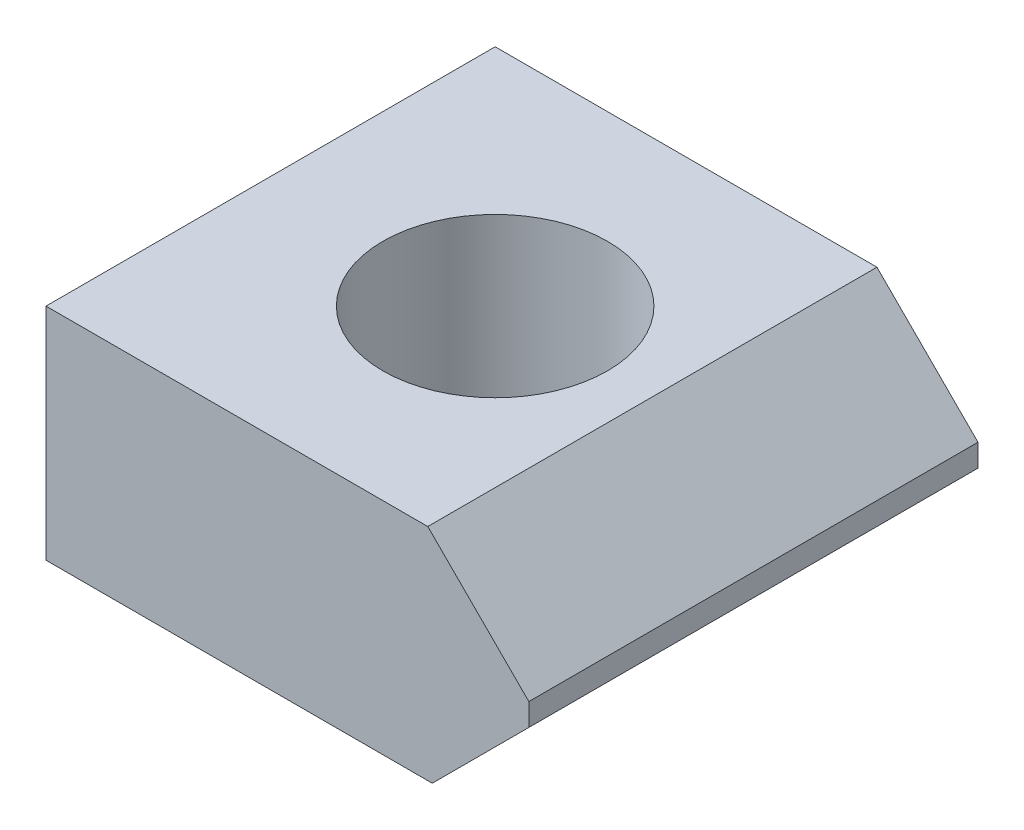
ISO-10303-21;
HEADER;
FILE_DESCRIPTION(('STEP AP214'),'2;1');
FILE_NAME('part.step','',(''),(''),'','','');
FILE_SCHEMA(('AUTOMOTIVE_DESIGN { 1 0 10303 214 1 1 1 1 }'));
ENDSEC;
DATA;
#1=APPLICATION_CONTEXT('core data for automotive mechanical design processes');
#2=APPLICATION_PROTOCOL_DEFINITION('international standard','automotive_design',2000,#1);
#3=PRODUCT_CONTEXT('',#1,'mechanical');
#4=PRODUCT('Part','Part','',(#3));
#5=PRODUCT_RELATED_PRODUCT_CATEGORY('part','',(#4));
#6=PRODUCT_DEFINITION_FORMATION('','',#4);
#7=PRODUCT_DEFINITION_CONTEXT('part definition',#1,'design');
#8=PRODUCT_DEFINITION('design','',#6,#7);
#9=PRODUCT_DEFINITION_SHAPE('','',#8);
#10=(LENGTH_UNIT() NAMED_UNIT(*) SI_UNIT(.MILLI.,.METRE.));
#11=(NAMED_UNIT(*) PLANE_ANGLE_UNIT() SI_UNIT($,.RADIAN.));
#12=(NAMED_UNIT(*) SI_UNIT($,.STERADIAN.) SOLID_ANGLE_UNIT());
#13=UNCERTAINTY_MEASURE_WITH_UNIT(LENGTH_MEASURE(1.E-05),#10,'distance_accuracy_value','');
#14=(GEOMETRIC_REPRESENTATION_CONTEXT(3) GLOBAL_UNCERTAINTY_ASSIGNED_CONTEXT((#13)) GLOBAL_UNIT_ASSIGNED_CONTEXT((#10,
#11,#12)) REPRESENTATION_CONTEXT('',''));
#15=CARTESIAN_POINT('',(0.,0.,0.));
#16=DIRECTION('',(0.,0.,1.));
#17=DIRECTION('',(1.,0.,0.));
#18=AXIS2_PLACEMENT_3D('',#15,#16,#17);
#19=CARTESIAN_POINT('',(17.,15.5,0.));
#20=DIRECTION('',(0.707106781186548,0.707106781186548,0.));
#21=DIRECTION('',(-0.707106781186548,0.707106781186548,0.));
#22=AXIS2_PLACEMENT_3D('',#19,#20,#21);
#23=PLANE('',#22);
#24=DIRECTION('',(0.,0.,-1.));
#25=VECTOR('',#24,1.);
#26=CARTESIAN_POINT('',(21.5,11.,20.));
#27=LINE('',#26,#25);
#28=CARTESIAN_POINT('',(21.5,11.,-20.));
#29=VERTEX_POINT('',#28);
#30=CARTESIAN_POINT('',(21.5,11.,20.));
#31=VERTEX_POINT('',#30);
#32=EDGE_CURVE('E73',#29,#31,#27,.F.);
#33=ORIENTED_EDGE('',*,*,#32,.F.);
#34=DIRECTION('',(0.707106781186547,-0.707106781186547,0.));
#35=VECTOR('',#34,1.);
#36=CARTESIAN_POINT('',(12.5,20.,-20.));
#37=LINE('',#36,#35);
#38=CARTESIAN_POINT('',(12.5,20.,-20.));
#39=VERTEX_POINT('',#38);
#40=EDGE_CURVE('E104',#39,#29,#37,.T.);
#41=ORIENTED_EDGE('',*,*,#40,.F.);
#42=DIRECTION('',(0.,0.,1.));
#43=VECTOR('',#42,1.);
#44=CARTESIAN_POINT('',(12.5,20.,0.));
#45=LINE('',#44,#43);
#46=CARTESIAN_POINT('',(12.5,20.,20.));
#47=VERTEX_POINT('',#46);
#48=EDGE_CURVE('E81',#47,#39,#45,.F.);
#49=ORIENTED_EDGE('',*,*,#48,.F.);
#50=DIRECTION('',(-0.707106781186547,0.707106781186547,0.));
#51=VECTOR('',#50,1.);
#52=CARTESIAN_POINT('',(21.5,11.,20.));
#53=LINE('',#52,#51);
#54=EDGE_CURVE('E66',#31,#47,#53,.T.);
#55=ORIENTED_EDGE('',*,*,#54,.F.);
#56=EDGE_LOOP('',(#33,#41,#49,#55));
#57=FACE_BOUND('',#56,.T.);
#58=ADVANCED_FACE('F17',(#57),#23,.T.);
#59=CARTESIAN_POINT('',(21.5,0.,20.));
#60=DIRECTION('',(1.,0.,0.));
#61=DIRECTION('',(0.,0.,-1.));
#62=AXIS2_PLACEMENT_3D('',#59,#60,#61);
#63=PLANE('',#62);
#64=DIRECTION('',(0.,1.,0.));
#65=VECTOR('',#64,1.);
#66=CARTESIAN_POINT('',(21.5,0.,-20.));
#67=LINE('',#66,#65);
#68=CARTESIAN_POINT('',(21.5,9.,-20.));
#69=VERTEX_POINT('',#68);
#70=EDGE_CURVE('E78',#29,#69,#67,.F.);
#71=ORIENTED_EDGE('',*,*,#70,.F.);
#72=ORIENTED_EDGE('',*,*,#32,.T.);
#73=DIRECTION('',(0.,1.,0.));
#74=VECTOR('',#73,1.);
#75=CARTESIAN_POINT('',(21.5,0.,20.));
#76=LINE('',#75,#74);
#77=CARTESIAN_POINT('',(21.5,9.,20.));
#78=VERTEX_POINT('',#77);
#79=EDGE_CURVE('E76',#78,#31,#76,.T.);
#80=ORIENTED_EDGE('',*,*,#79,.F.);
#81=DIRECTION('',(0.,0.,1.));
#82=VECTOR('',#81,1.);
#83=CARTESIAN_POINT('',(21.5,9.,0.));
#84=LINE('',#83,#82);
#85=EDGE_CURVE('E114',#69,#78,#84,.T.);
#86=ORIENTED_EDGE('',*,*,#85,.F.);
#87=EDGE_LOOP('',(#71,#72,#80,#86));
#88=FACE_BOUND('',#87,.T.);
#89=ADVANCED_FACE('F74',(#88),#63,.T.);
#90=CARTESIAN_POINT('',(0.,20.,0.));
#91=DIRECTION('',(0.,1.,0.));
#92=DIRECTION('',(0.,0.,1.));
#93=AXIS2_PLACEMENT_3D('',#90,#91,#92);
#94=PLANE('',#93);
#95=CARTESIAN_POINT('',(-1.5,20.,0.));
#96=DIRECTION('',(0.,1.,0.));
#97=DIRECTION('',(0.,0.,1.));
#98=AXIS2_PLACEMENT_3D('',#95,#96,#97);
#99=CIRCLE('',#98,10.);
#100=CARTESIAN_POINT('',(-1.5,20.,10.));
#101=VERTEX_POINT('',#100);
#102=EDGE_CURVE('E20',#101,#101,#99,.F.);
#103=ORIENTED_EDGE('',*,*,#102,.T.);
#104=EDGE_LOOP('',(#103));
#105=FACE_BOUND('',#104,.T.);
#106=DIRECTION('',(1.,0.,0.));
#107=VECTOR('',#106,1.);
#108=CARTESIAN_POINT('',(-21.5,20.,20.));
#109=LINE('',#108,#107);
#110=CARTESIAN_POINT('',(-21.5,20.,20.));
#111=VERTEX_POINT('',#110);
#112=EDGE_CURVE('E89',#47,#111,#109,.F.);
#113=ORIENTED_EDGE('',*,*,#112,.F.);
#114=ORIENTED_EDGE('',*,*,#48,.T.);
#115=DIRECTION('',(-1.,0.,0.));
#116=VECTOR('',#115,1.);
#117=CARTESIAN_POINT('',(21.5,20.,-20.));
#118=LINE('',#117,#116);
#119=CARTESIAN_POINT('',(-21.5,20.,-20.));
#120=VERTEX_POINT('',#119);
#121=EDGE_CURVE('E101',#120,#39,#118,.F.);
#122=ORIENTED_EDGE('',*,*,#121,.F.);
#123=DIRECTION('',(0.,0.,1.));
#124=VECTOR('',#123,1.);
#125=CARTESIAN_POINT('',(-21.5,20.,-20.));
#126=LINE('',#125,#124);
#127=EDGE_CURVE('E86',#111,#120,#126,.F.);
#128=ORIENTED_EDGE('',*,*,#127,.F.);
#129=EDGE_LOOP('',(#113,#114,#122,#128));
#130=FACE_BOUND('',#129,.T.);
#131=ADVANCED_FACE('F99',(#105,#130),#94,.T.);
#132=CARTESIAN_POINT('',(-21.5,0.,-20.));
#133=DIRECTION('',(-1.,0.,0.));
#134=DIRECTION('',(0.,0.,1.));
#135=AXIS2_PLACEMENT_3D('',#132,#133,#134);
#136=PLANE('',#135);
#137=DIRECTION('',(0.,1.,0.));
#138=VECTOR('',#137,1.);
#139=CARTESIAN_POINT('',(-21.5,0.,-20.));
#140=LINE('',#139,#138);
#141=CARTESIAN_POINT('',(-21.5,0.4,-20.));
#142=VERTEX_POINT('',#141);
#143=EDGE_CURVE('E106',#142,#120,#140,.T.);
#144=ORIENTED_EDGE('',*,*,#143,.F.);
#145=DIRECTION('',(0.,0.,1.));
#146=VECTOR('',#145,1.);
#147=CARTESIAN_POINT('',(-21.5,0.4,-20.));
#148=LINE('',#147,#146);
#149=CARTESIAN_POINT('',(-21.5,0.4,20.));
#150=VERTEX_POINT('',#149);
#151=EDGE_CURVE('E123',#142,#150,#148,.T.);
#152=ORIENTED_EDGE('',*,*,#151,.T.);
#153=DIRECTION('',(0.,1.,0.));
#154=VECTOR('',#153,1.);
#155=CARTESIAN_POINT('',(-21.5,0.,20.));
#156=LINE('',#155,#154);
#157=EDGE_CURVE('E91',#111,#150,#156,.F.);
#158=ORIENTED_EDGE('',*,*,#157,.F.);
#159=ORIENTED_EDGE('',*,*,#127,.T.);
#160=EDGE_LOOP('',(#144,#152,#158,#159));
#161=FACE_BOUND('',#160,.T.);
#162=ADVANCED_FACE('F127',(#161),#136,.T.);
#163=CARTESIAN_POINT('',(-21.5,0.,20.));
#164=DIRECTION('',(0.,0.,1.));
#165=DIRECTION('',(1.,0.,0.));
#166=AXIS2_PLACEMENT_3D('',#163,#164,#165);
#167=PLANE('',#166);
#168=ORIENTED_EDGE('',*,*,#157,.T.);
#169=DIRECTION('',(1.,0.,0.));
#170=VECTOR('',#169,1.);
#171=CARTESIAN_POINT('',(-29.9353006374,0.4,20.));
#172=LINE('',#171,#170);
#173=CARTESIAN_POINT('',(12.9,0.4,20.));
#174=VERTEX_POINT('',#173);
#175=EDGE_CURVE('E117',#150,#174,#172,.T.);
#176=ORIENTED_EDGE('',*,*,#175,.T.);
#177=DIRECTION('',(0.707106781186548,0.707106781186548,0.));
#178=VECTOR('',#177,1.);
#179=CARTESIAN_POINT('',(17.,4.5,20.));
#180=LINE('',#179,#178);
#181=EDGE_CURVE('E85',#78,#174,#180,.F.);
#182=ORIENTED_EDGE('',*,*,#181,.F.);
#183=ORIENTED_EDGE('',*,*,#79,.T.);
#184=ORIENTED_EDGE('',*,*,#54,.T.);
#185=ORIENTED_EDGE('',*,*,#112,.T.);
#186=EDGE_LOOP('',(#168,#176,#182,#183,#184,#185));
#187=FACE_BOUND('',#186,.T.);
#188=ADVANCED_FACE('F83',(#187),#167,.T.);
#189=CARTESIAN_POINT('',(17.,4.5,0.));
#190=DIRECTION('',(0.707106781186548,-0.707106781186548,0.));
#191=DIRECTION('',(0.707106781186548,0.707106781186548,0.));
#192=AXIS2_PLACEMENT_3D('',#189,#190,#191);
#193=PLANE('',#192);
#194=ORIENTED_EDGE('',*,*,#181,.T.);
#195=DIRECTION('',(0.,0.,1.));
#196=VECTOR('',#195,1.);
#197=CARTESIAN_POINT('',(12.9,0.4,-20.));
#198=LINE('',#197,#196);
#199=CARTESIAN_POINT('',(12.9,0.4,-20.));
#200=VERTEX_POINT('',#199);
#201=EDGE_CURVE('E125',#174,#200,#198,.F.);
#202=ORIENTED_EDGE('',*,*,#201,.T.);
#203=DIRECTION('',(-0.707106781186548,-0.707106781186548,0.));
#204=VECTOR('',#203,1.);
#205=CARTESIAN_POINT('',(21.5,9.,-20.));
#206=LINE('',#205,#204);
#207=EDGE_CURVE('E34',#69,#200,#206,.T.);
#208=ORIENTED_EDGE('',*,*,#207,.F.);
#209=ORIENTED_EDGE('',*,*,#85,.T.);
#210=EDGE_LOOP('',(#194,#202,#208,#209));
#211=FACE_BOUND('',#210,.T.);
#212=ADVANCED_FACE('F133',(#211),#193,.T.);
#213=CARTESIAN_POINT('',(21.5,0.,-20.));
#214=DIRECTION('',(0.,0.,-1.));
#215=DIRECTION('',(-1.,0.,0.));
#216=AXIS2_PLACEMENT_3D('',#213,#214,#215);
#217=PLANE('',#216);
#218=ORIENTED_EDGE('',*,*,#207,.T.);
#219=DIRECTION('',(1.,0.,0.));
#220=VECTOR('',#219,1.);
#221=CARTESIAN_POINT('',(-29.9353006374,0.4,-20.));
#222=LINE('',#221,#220);
#223=EDGE_CURVE('E26',#200,#142,#222,.F.);
#224=ORIENTED_EDGE('',*,*,#223,.T.);
#225=ORIENTED_EDGE('',*,*,#143,.T.);
#226=ORIENTED_EDGE('',*,*,#121,.T.);
#227=ORIENTED_EDGE('',*,*,#40,.T.);
#228=ORIENTED_EDGE('',*,*,#70,.T.);
#229=EDGE_LOOP('',(#218,#224,#225,#226,#227,#228));
#230=FACE_BOUND('',#229,.T.);
#231=ADVANCED_FACE('F103',(#230),#217,.T.);
#232=CARTESIAN_POINT('',(-1.5,20.,0.));
#233=DIRECTION('',(0.,1.,0.));
#234=DIRECTION('',(0.,0.,1.));
#235=AXIS2_PLACEMENT_3D('',#232,#233,#234);
#236=CYLINDRICAL_SURFACE('',#235,10.);
#237=ORIENTED_EDGE('',*,*,#102,.F.);
#238=EDGE_LOOP('',(#237));
#239=FACE_BOUND('',#238,.T.);
#240=CARTESIAN_POINT('',(-1.5,0.400000000000001,0.));
#241=DIRECTION('',(0.,1.,0.));
#242=DIRECTION('',(0.,0.,1.));
#243=AXIS2_PLACEMENT_3D('',#240,#241,#242);
#244=CIRCLE('',#243,10.);
#245=CARTESIAN_POINT('',(-1.5,0.400000000000001,10.));
#246=VERTEX_POINT('',#245);
#247=EDGE_CURVE('E11',#246,#246,#244,.F.);
#248=ORIENTED_EDGE('',*,*,#247,.T.);
#249=EDGE_LOOP('',(#248));
#250=FACE_BOUND('',#249,.T.);
#251=ADVANCED_FACE('F141',(#239,#250),#236,.F.);
#252=CARTESIAN_POINT('',(-29.9353006374,0.4,-20.));
#253=DIRECTION('',(0.,1.,0.));
#254=DIRECTION('',(0.,0.,1.));
#255=AXIS2_PLACEMENT_3D('',#252,#253,#254);
#256=PLANE('',#255);
#257=ORIENTED_EDGE('',*,*,#247,.F.);
#258=EDGE_LOOP('',(#257));
#259=FACE_BOUND('',#258,.T.);
#260=ORIENTED_EDGE('',*,*,#201,.F.);
#261=ORIENTED_EDGE('',*,*,#175,.F.);
#262=ORIENTED_EDGE('',*,*,#151,.F.);
#263=ORIENTED_EDGE('',*,*,#223,.F.);
#264=EDGE_LOOP('',(#260,#261,#262,#263));
#265=FACE_BOUND('',#264,.T.);
#266=ADVANCED_FACE('F122',(#259,#265),#256,.F.);
#267=CLOSED_SHELL('',(#58,#89,#131,#162,#188,#212,#231,#251,#266));
#268=MANIFOLD_SOLID_BREP('B1',#267);
#269=ADVANCED_BREP_SHAPE_REPRESENTATION('',(#18,#268),#14);
#270=SHAPE_DEFINITION_REPRESENTATION(#9,#269);
ENDSEC;
END-ISO-10303-21;
